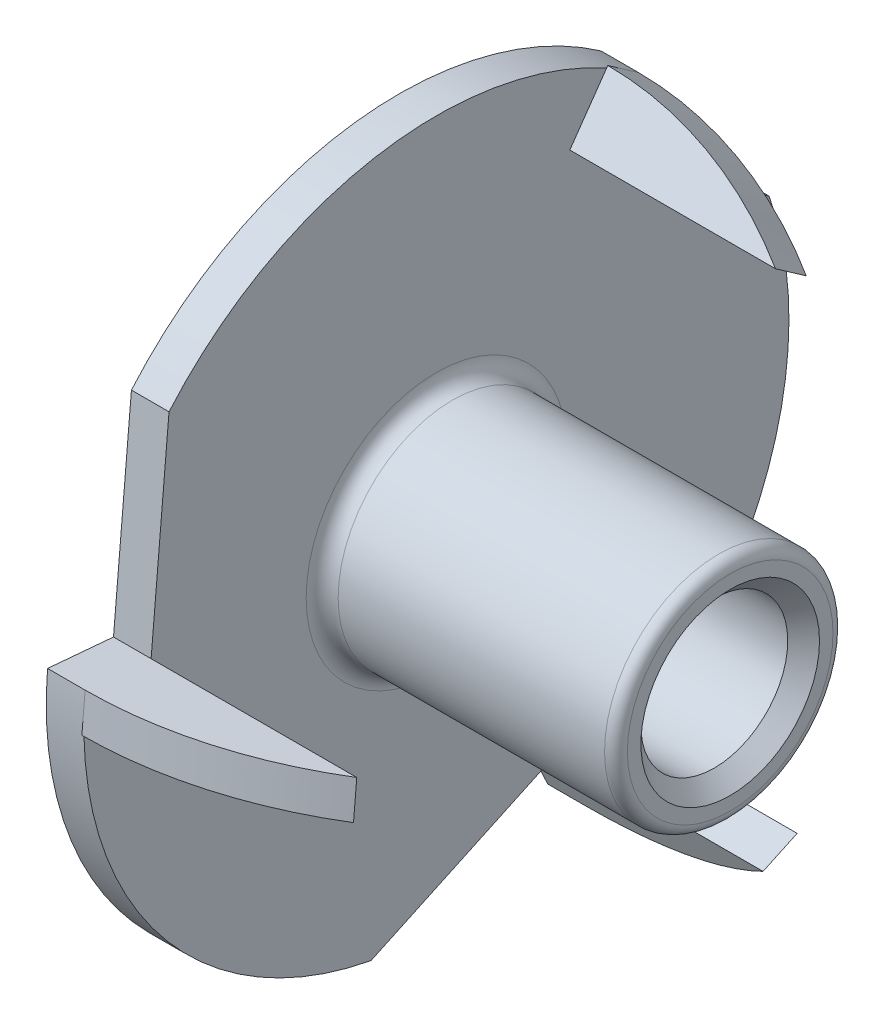
ISO-10303-21;
HEADER;
FILE_DESCRIPTION(('STEP AP214'),'2;1');
FILE_NAME('part.step','',(''),(''),'','','');
FILE_SCHEMA(('AUTOMOTIVE_DESIGN { 1 0 10303 214 1 1 1 1 }'));
ENDSEC;
DATA;
#1=APPLICATION_CONTEXT('core data for automotive mechanical design processes');
#2=APPLICATION_PROTOCOL_DEFINITION('international standard','automotive_design',2000,#1);
#3=PRODUCT_CONTEXT('',#1,'mechanical');
#4=PRODUCT('Part','Part','',(#3));
#5=PRODUCT_RELATED_PRODUCT_CATEGORY('part','',(#4));
#6=PRODUCT_DEFINITION_FORMATION('','',#4);
#7=PRODUCT_DEFINITION_CONTEXT('part definition',#1,'design');
#8=PRODUCT_DEFINITION('design','',#6,#7);
#9=PRODUCT_DEFINITION_SHAPE('','',#8);
#10=(LENGTH_UNIT() NAMED_UNIT(*) SI_UNIT(.MILLI.,.METRE.));
#11=(NAMED_UNIT(*) PLANE_ANGLE_UNIT() SI_UNIT($,.RADIAN.));
#12=(NAMED_UNIT(*) SI_UNIT($,.STERADIAN.) SOLID_ANGLE_UNIT());
#13=UNCERTAINTY_MEASURE_WITH_UNIT(LENGTH_MEASURE(1.E-05),#10,'distance_accuracy_value','');
#14=(GEOMETRIC_REPRESENTATION_CONTEXT(3) GLOBAL_UNCERTAINTY_ASSIGNED_CONTEXT((#13)) GLOBAL_UNIT_ASSIGNED_CONTEXT((#10,
#11,#12)) REPRESENTATION_CONTEXT('',''));
#15=CARTESIAN_POINT('',(0.,0.,0.));
#16=DIRECTION('',(0.,0.,1.));
#17=DIRECTION('',(1.,0.,0.));
#18=AXIS2_PLACEMENT_3D('',#15,#16,#17);
#19=CARTESIAN_POINT('',(8.64489,0.,0.));
#20=DIRECTION('',(1.,0.,0.));
#21=DIRECTION('',(0.,0.,-1.));
#22=AXIS2_PLACEMENT_3D('',#19,#20,#21);
#23=TOROIDAL_SURFACE('',#22,2.77749,0.30861);
#24=CARTESIAN_POINT('',(8.9535,0.,0.));
#25=DIRECTION('',(-1.,0.,0.));
#26=DIRECTION('',(0.,0.,-1.));
#27=AXIS2_PLACEMENT_3D('',#24,#25,#26);
#28=CIRCLE('',#27,2.77749);
#29=CARTESIAN_POINT('',(8.9535,0.,2.77749));
#30=VERTEX_POINT('',#29);
#31=CARTESIAN_POINT('',(8.9535,0.,-2.77749));
#32=VERTEX_POINT('',#31);
#33=EDGE_CURVE('E138',#30,#32,#28,.F.);
#34=ORIENTED_EDGE('',*,*,#33,.F.);
#35=CARTESIAN_POINT('',(8.9535,0.,0.));
#36=DIRECTION('',(-1.,0.,0.));
#37=DIRECTION('',(0.,0.,1.));
#38=AXIS2_PLACEMENT_3D('',#35,#36,#37);
#39=CIRCLE('',#38,2.77749);
#40=EDGE_CURVE('E141',#32,#30,#39,.F.);
#41=ORIENTED_EDGE('',*,*,#40,.F.);
#42=EDGE_LOOP('',(#34,#41));
#43=FACE_BOUND('',#42,.T.);
#44=CARTESIAN_POINT('',(8.64489,0.,0.));
#45=DIRECTION('',(-1.,0.,0.));
#46=DIRECTION('',(0.,0.,1.));
#47=AXIS2_PLACEMENT_3D('',#44,#45,#46);
#48=CIRCLE('',#47,3.0861);
#49=CARTESIAN_POINT('',(8.64489,0.,3.0861));
#50=VERTEX_POINT('',#49);
#51=EDGE_CURVE('E149',#50,#50,#48,.T.);
#52=ORIENTED_EDGE('',*,*,#51,.F.);
#53=EDGE_LOOP('',(#52));
#54=FACE_BOUND('',#53,.T.);
#55=ADVANCED_FACE('F16',(#43,#54),#23,.T.);
#56=CARTESIAN_POINT('',(8.9535,0.,-1.54305));
#57=DIRECTION('',(1.,0.,0.));
#58=DIRECTION('',(0.,0.,-1.));
#59=AXIS2_PLACEMENT_3D('',#56,#57,#58);
#60=PLANE('',#59);
#61=ORIENTED_EDGE('',*,*,#33,.T.);
#62=ORIENTED_EDGE('',*,*,#40,.T.);
#63=EDGE_LOOP('',(#61,#62));
#64=FACE_BOUND('',#63,.T.);
#65=CARTESIAN_POINT('',(8.95350000001827,0.,0.));
#66=DIRECTION('',(1.,0.,0.));
#67=DIRECTION('',(0.,0.,-1.));
#68=AXIS2_PLACEMENT_3D('',#65,#66,#67);
#69=CIRCLE('',#68,2.41299999993316);
#70=CARTESIAN_POINT('',(8.95350000001827,0.,-2.41299999993316));
#71=VERTEX_POINT('',#70);
#72=EDGE_CURVE('E216',#71,#71,#69,.F.);
#73=ORIENTED_EDGE('',*,*,#72,.T.);
#74=EDGE_LOOP('',(#73));
#75=FACE_BOUND('',#74,.T.);
#76=ADVANCED_FACE('F147',(#64,#75),#60,.T.);
#77=CARTESIAN_POINT('',(4.98475,0.,0.));
#78=DIRECTION('',(-1.,0.,0.));
#79=DIRECTION('',(0.,0.,1.));
#80=AXIS2_PLACEMENT_3D('',#77,#78,#79);
#81=CYLINDRICAL_SURFACE('',#80,3.0861);
#82=CARTESIAN_POINT('',(1.44805400254,0.,0.));
#83=DIRECTION('',(1.,0.,0.));
#84=DIRECTION('',(0.,0.,-1.));
#85=AXIS2_PLACEMENT_3D('',#82,#83,#84);
#86=CIRCLE('',#85,3.08610000254);
#87=CARTESIAN_POINT('',(1.44805400254,0.,-3.08610000254));
#88=VERTEX_POINT('',#87);
#89=EDGE_CURVE('E215',#88,#88,#86,.T.);
#90=ORIENTED_EDGE('',*,*,#89,.T.);
#91=EDGE_LOOP('',(#90));
#92=FACE_BOUND('',#91,.T.);
#93=ORIENTED_EDGE('',*,*,#51,.T.);
#94=EDGE_LOOP('',(#93));
#95=FACE_BOUND('',#94,.T.);
#96=ADVANCED_FACE('F166',(#92,#95),#81,.T.);
#97=CARTESIAN_POINT('',(8.95350000013195,0.,0.));
#98=DIRECTION('',(1.,0.,0.));
#99=DIRECTION('',(0.,0.,-1.));
#100=AXIS2_PLACEMENT_3D('',#97,#98,#99);
#101=CONICAL_SURFACE('',#100,2.41300000004685,0.785398163397448);
#102=ORIENTED_EDGE('',*,*,#72,.F.);
#103=EDGE_LOOP('',(#102));
#104=FACE_BOUND('',#103,.T.);
#105=CARTESIAN_POINT('',(8.52424,0.,0.));
#106=DIRECTION('',(-1.,0.,0.));
#107=DIRECTION('',(0.,-1.,0.));
#108=AXIS2_PLACEMENT_3D('',#105,#106,#107);
#109=CIRCLE('',#108,1.98374);
#110=CARTESIAN_POINT('',(8.52424,-1.98374,0.));
#111=VERTEX_POINT('',#110);
#112=EDGE_CURVE('E221',#111,#111,#109,.T.);
#113=ORIENTED_EDGE('',*,*,#112,.T.);
#114=EDGE_LOOP('',(#113));
#115=FACE_BOUND('',#114,.T.);
#116=ADVANCED_FACE('F170',(#104,#115),#101,.F.);
#117=CARTESIAN_POINT('',(3.45747575498561,7.44173273243971,-3.97045037441459));
#118=DIRECTION('',(0.,-0.573576436351046,-0.819152044288992));
#119=DIRECTION('',(0.,0.819152044288992,-0.573576436351046));
#120=AXIS2_PLACEMENT_3D('',#117,#118,#119);
#121=PLANE('',#120);
#122=DIRECTION('',(0.,0.819152044289043,-0.573576436350973));
#123=VECTOR('',#122,1.);
#124=CARTESIAN_POINT('',(1.016,8.34066278230974,-4.59988797165682));
#125=LINE('',#124,#123);
#126=CARTESIAN_POINT('',(1.016,8.34066278230974,-4.59988797165682));
#127=VERTEX_POINT('',#126);
#128=CARTESIAN_POINT('',(1.016,8.38517688118555,-4.63105707924576));
#129=VERTEX_POINT('',#128);
#130=EDGE_CURVE('E213',#127,#129,#125,.T.);
#131=ORIENTED_EDGE('',*,*,#130,.F.);
#132=DIRECTION('',(0.,0.819152044288989,-0.573576436351049));
#133=VECTOR('',#132,1.);
#134=CARTESIAN_POINT('',(1.016,6.92013820387929,-3.60522595362764));
#135=LINE('',#134,#133);
#136=CARTESIAN_POINT('',(1.016,6.92013820387929,-3.60522595362764));
#137=VERTEX_POINT('',#136);
#138=EDGE_CURVE('E473',#137,#127,#135,.T.);
#139=ORIENTED_EDGE('',*,*,#138,.F.);
#140=DIRECTION('',(1.,0.,0.));
#141=VECTOR('',#140,1.);
#142=CARTESIAN_POINT('',(6.57225,6.92013820387928,-3.60522595362764));
#143=LINE('',#142,#141);
#144=CARTESIAN_POINT('',(6.57225000000001,6.92013820387929,-3.60522595362764));
#145=VERTEX_POINT('',#144);
#146=EDGE_CURVE('E204',#145,#137,#143,.F.);
#147=ORIENTED_EDGE('',*,*,#146,.F.);
#148=CARTESIAN_POINT('',(1.01599999999999,0.582753659332648,0.832258476997622));
#149=DIRECTION('',(0.,0.573576436351046,0.819152044288992));
#150=DIRECTION('',(0.,-0.819152044288992,0.573576436351046));
#151=AXIS2_PLACEMENT_3D('',#148,#149,#150);
#152=CIRCLE('',#151,9.52500000000002);
#153=EDGE_CURVE('E212',#129,#145,#152,.F.);
#154=ORIENTED_EDGE('',*,*,#153,.F.);
#155=EDGE_LOOP('',(#131,#139,#147,#154));
#156=FACE_BOUND('',#155,.T.);
#157=ADVANCED_FACE('F174',(#156),#121,.F.);
#158=CARTESIAN_POINT('',(3.45747575498561,-0.282355477511387,8.42995478167427));
#159=DIRECTION('',(0.,0.996194698091746,-0.0871557427476579));
#160=DIRECTION('',(0.,0.0871557427476579,0.996194698091746));
#161=AXIS2_PLACEMENT_3D('',#158,#159,#160);
#162=PLANE('',#161);
#163=DIRECTION('',(0.,0.0871557427476641,0.996194698091745));
#164=VECTOR('',#163,1.);
#165=CARTESIAN_POINT('',(1.016,-0.186711553137597,9.52316983970805));
#166=LINE('',#165,#164);
#167=CARTESIAN_POINT('',(1.016,-0.186711553137597,9.52316983970805));
#168=VERTEX_POINT('',#167);
#169=CARTESIAN_POINT('',(1.016,-0.181975363589741,9.57730473395549));
#170=VERTEX_POINT('',#169);
#171=EDGE_CURVE('E226',#168,#170,#166,.T.);
#172=ORIENTED_EDGE('',*,*,#171,.F.);
#173=DIRECTION('',(0.,0.0871557427476577,0.996194698091746));
#174=VECTOR('',#173,1.);
#175=CARTESIAN_POINT('',(1.016,-0.33785183971513,7.7956284590725));
#176=LINE('',#175,#174);
#177=CARTESIAN_POINT('',(1.016,-0.337851839715131,7.7956284590725));
#178=VERTEX_POINT('',#177);
#179=EDGE_CURVE('E488',#178,#168,#176,.T.);
#180=ORIENTED_EDGE('',*,*,#179,.F.);
#181=DIRECTION('',(1.,0.,0.));
#182=VECTOR('',#181,1.);
#183=CARTESIAN_POINT('',(6.57225,-0.337851839715132,7.79562845907249));
#184=LINE('',#183,#182);
#185=CARTESIAN_POINT('',(6.57225,-0.337851839715131,7.79562845907249));
#186=VERTEX_POINT('',#185);
#187=EDGE_CURVE('E222',#186,#178,#184,.F.);
#188=ORIENTED_EDGE('',*,*,#187,.F.);
#189=CARTESIAN_POINT('',(1.01599999999999,-1.01213381326121,0.0885502346316048));
#190=DIRECTION('',(0.,-0.996194698091746,0.0871557427476579));
#191=DIRECTION('',(0.,-0.0871557427476579,-0.996194698091746));
#192=AXIS2_PLACEMENT_3D('',#189,#190,#191);
#193=CIRCLE('',#192,9.52500000000001);
#194=EDGE_CURVE('E225',#170,#186,#193,.F.);
#195=ORIENTED_EDGE('',*,*,#194,.F.);
#196=EDGE_LOOP('',(#172,#180,#188,#195));
#197=FACE_BOUND('',#196,.T.);
#198=ADVANCED_FACE('F178',(#197),#162,.F.);
#199=CARTESIAN_POINT('',(3.45747575498561,-7.15937725492833,-4.45950440725968));
#200=DIRECTION('',(0.,-0.4226182617407,0.90630778703665));
#201=DIRECTION('',(0.,-0.90630778703665,-0.4226182617407));
#202=AXIS2_PLACEMENT_3D('',#199,#200,#201);
#203=PLANE('',#202);
#204=DIRECTION('',(0.,-0.90630778703665,-0.4226182617407));
#205=VECTOR('',#204,1.);
#206=CARTESIAN_POINT('',(1.016,-7.15937725492833,-4.45950440725968));
#207=LINE('',#206,#205);
#208=CARTESIAN_POINT('',(1.016,-8.15395122917215,-4.92328186805123));
#209=VERTEX_POINT('',#208);
#210=CARTESIAN_POINT('',(1.016,-8.20320151759554,-4.9462476547094));
#211=VERTEX_POINT('',#210);
#212=EDGE_CURVE('E116',#209,#211,#207,.T.);
#213=ORIENTED_EDGE('',*,*,#212,.F.);
#214=DIRECTION('',(0.,-0.906307787036649,-0.422618261740701));
#215=VECTOR('',#214,1.);
#216=CARTESIAN_POINT('',(1.016,-6.58228636416416,-4.19040250544486));
#217=LINE('',#216,#215);
#218=CARTESIAN_POINT('',(1.016,-6.58228636416416,-4.19040250544486));
#219=VERTEX_POINT('',#218);
#220=EDGE_CURVE('E250',#219,#209,#217,.T.);
#221=ORIENTED_EDGE('',*,*,#220,.F.);
#222=DIRECTION('',(1.,0.,0.));
#223=VECTOR('',#222,1.);
#224=CARTESIAN_POINT('',(6.57225,-6.58228636416416,-4.19040250544486));
#225=LINE('',#224,#223);
#226=CARTESIAN_POINT('',(6.57224999999999,-6.58228636416416,-4.19040250544486));
#227=VERTEX_POINT('',#226);
#228=EDGE_CURVE('E217',#227,#219,#225,.F.);
#229=ORIENTED_EDGE('',*,*,#228,.F.);
#230=CARTESIAN_POINT('',(1.01599999999999,0.429380153928564,-0.920808711629228));
#231=DIRECTION('',(0.,0.4226182617407,-0.90630778703665));
#232=DIRECTION('',(0.,0.90630778703665,0.4226182617407));
#233=AXIS2_PLACEMENT_3D('',#230,#231,#232);
#234=CIRCLE('',#233,9.52500000000001);
#235=EDGE_CURVE('E220',#211,#227,#234,.F.);
#236=ORIENTED_EDGE('',*,*,#235,.F.);
#237=EDGE_LOOP('',(#213,#221,#229,#236));
#238=FACE_BOUND('',#237,.T.);
#239=ADVANCED_FACE('F182',(#238),#203,.F.);
#240=CARTESIAN_POINT('',(1.44805400254,0.,0.));
#241=DIRECTION('',(1.,0.,0.));
#242=DIRECTION('',(0.,0.,-1.));
#243=AXIS2_PLACEMENT_3D('',#240,#241,#242);
#244=TOROIDAL_SURFACE('',#243,3.51815400254,0.432054);
#245=ORIENTED_EDGE('',*,*,#89,.F.);
#246=EDGE_LOOP('',(#245));
#247=FACE_BOUND('',#246,.T.);
#248=CARTESIAN_POINT('',(1.01600000254,0.,0.));
#249=DIRECTION('',(1.,0.,0.));
#250=DIRECTION('',(0.,0.,1.));
#251=AXIS2_PLACEMENT_3D('',#248,#249,#250);
#252=CIRCLE('',#251,3.51815400254);
#253=CARTESIAN_POINT('',(1.016000001524,0.,-3.518154002032));
#254=VERTEX_POINT('',#253);
#255=CARTESIAN_POINT('',(1.016000001524,0.,3.518154001016));
#256=VERTEX_POINT('',#255);
#257=EDGE_CURVE('E232',#254,#256,#252,.F.);
#258=ORIENTED_EDGE('',*,*,#257,.F.);
#259=CARTESIAN_POINT('',(1.01600000254,0.,0.));
#260=DIRECTION('',(1.,0.,0.));
#261=DIRECTION('',(0.,0.,-1.));
#262=AXIS2_PLACEMENT_3D('',#259,#260,#261);
#263=CIRCLE('',#262,3.51815400127);
#264=EDGE_CURVE('E124',#256,#254,#263,.F.);
#265=ORIENTED_EDGE('',*,*,#264,.F.);
#266=EDGE_LOOP('',(#258,#265));
#267=FACE_BOUND('',#266,.T.);
#268=ADVANCED_FACE('F186',(#247,#267),#244,.F.);
#269=CARTESIAN_POINT('',(4.47675,0.,0.));
#270=DIRECTION('',(-1.,0.,0.));
#271=DIRECTION('',(0.,-1.,0.));
#272=AXIS2_PLACEMENT_3D('',#269,#270,#271);
#273=CYLINDRICAL_SURFACE('',#272,1.98374);
#274=ORIENTED_EDGE('',*,*,#112,.F.);
#275=EDGE_LOOP('',(#274));
#276=FACE_BOUND('',#275,.T.);
#277=CARTESIAN_POINT('',(0.429259999975784,0.,0.));
#278=DIRECTION('',(-1.,0.,0.));
#279=DIRECTION('',(0.,0.,1.));
#280=AXIS2_PLACEMENT_3D('',#277,#278,#279);
#281=CIRCLE('',#280,1.98374000001422);
#282=CARTESIAN_POINT('',(0.429259999975784,0.,1.98374000001422));
#283=VERTEX_POINT('',#282);
#284=EDGE_CURVE('E199',#283,#283,#281,.T.);
#285=ORIENTED_EDGE('',*,*,#284,.T.);
#286=EDGE_LOOP('',(#285));
#287=FACE_BOUND('',#286,.T.);
#288=ADVANCED_FACE('F192',(#276,#287),#273,.F.);
#289=CARTESIAN_POINT('',(6.57225,-7.01166651809271,-3.26959379381562));
#290=DIRECTION('',(0.,0.90630778703665,0.4226182617407));
#291=DIRECTION('',(0.,-0.4226182617407,0.90630778703665));
#292=AXIS2_PLACEMENT_3D('',#289,#290,#291);
#293=PLANE('',#292);
#294=DIRECTION('',(1.,0.,0.));
#295=VECTOR('',#294,1.);
#296=CARTESIAN_POINT('',(1.016,-7.01166651809271,-3.26959379381563));
#297=LINE('',#296,#295);
#298=CARTESIAN_POINT('',(1.016,-7.01166651809271,-3.26959379381563));
#299=VERTEX_POINT('',#298);
#300=CARTESIAN_POINT('',(6.57224999999999,-7.01166651809271,-3.26959379381563));
#301=VERTEX_POINT('',#300);
#302=EDGE_CURVE('E398',#299,#301,#297,.T.);
#303=ORIENTED_EDGE('',*,*,#302,.T.);
#304=DIRECTION('',(0.,0.4226182617407,-0.90630778703665));
#305=VECTOR('',#304,1.);
#306=CARTESIAN_POINT('',(6.57225,-7.0116665180927,-3.26959379381562));
#307=LINE('',#306,#305);
#308=EDGE_CURVE('E406',#227,#301,#307,.F.);
#309=ORIENTED_EDGE('',*,*,#308,.F.);
#310=ORIENTED_EDGE('',*,*,#228,.T.);
#311=DIRECTION('',(0.,0.422618261740701,-0.906307787036649));
#312=VECTOR('',#311,1.);
#313=CARTESIAN_POINT('',(1.016,-7.01166651809271,-3.26959379381563));
#314=LINE('',#313,#312);
#315=EDGE_CURVE('E497',#299,#219,#314,.T.);
#316=ORIENTED_EDGE('',*,*,#315,.F.);
#317=EDGE_LOOP('',(#303,#309,#310,#316));
#318=FACE_BOUND('',#317,.T.);
#319=ADVANCED_FACE('F290',(#318),#293,.T.);
#320=CARTESIAN_POINT('',(1.01599999999999,0.,0.));
#321=DIRECTION('',(0.,0.4226182617407,-0.90630778703665));
#322=DIRECTION('',(0.,0.90630778703665,0.4226182617407));
#323=AXIS2_PLACEMENT_3D('',#320,#321,#322);
#324=CYLINDRICAL_SURFACE('',#323,9.52500000000001);
#325=CARTESIAN_POINT('',(1.01599999999999,0.,0.));
#326=DIRECTION('',(0.,0.4226182617407,-0.90630778703665));
#327=DIRECTION('',(0.,0.90630778703665,0.4226182617407));
#328=AXIS2_PLACEMENT_3D('',#325,#326,#327);
#329=CIRCLE('',#328,9.52500000000001);
#330=CARTESIAN_POINT('',(1.01599999999999,-8.63258167152409,-4.02543894308017));
#331=VERTEX_POINT('',#330);
#332=EDGE_CURVE('E395',#301,#331,#329,.T.);
#333=ORIENTED_EDGE('',*,*,#332,.T.);
#334=DIRECTION('',(0.,-0.422618261740701,0.906307787036649));
#335=VECTOR('',#334,1.);
#336=CARTESIAN_POINT('',(1.016,-8.20320151759554,-4.9462476547094));
#337=LINE('',#336,#335);
#338=EDGE_CURVE('E241',#211,#331,#337,.T.);
#339=ORIENTED_EDGE('',*,*,#338,.F.);
#340=ORIENTED_EDGE('',*,*,#235,.T.);
#341=ORIENTED_EDGE('',*,*,#308,.T.);
#342=EDGE_LOOP('',(#333,#339,#340,#341));
#343=FACE_BOUND('',#342,.T.);
#344=ADVANCED_FACE('F287',(#343),#324,.T.);
#345=CARTESIAN_POINT('',(1.016,0.674281973546084,7.70707822444088));
#346=DIRECTION('',(-1.,0.,0.));
#347=DIRECTION('',(0.,0.,1.));
#348=AXIS2_PLACEMENT_3D('',#345,#346,#347);
#349=PLANE('',#348);
#350=DIRECTION('',(0.,-0.996194698091746,0.0871557427476579));
#351=VECTOR('',#350,1.);
#352=CARTESIAN_POINT('',(1.016,0.830158449671443,9.48875449932387));
#353=LINE('',#352,#351);
#354=CARTESIAN_POINT('',(1.01599999999999,0.830158449671442,9.48875449932388));
#355=VERTEX_POINT('',#354);
#356=EDGE_CURVE('E482',#355,#170,#353,.T.);
#357=ORIENTED_EDGE('',*,*,#356,.F.);
#358=CARTESIAN_POINT('',(1.016,0.,0.));
#359=DIRECTION('',(-1.,0.,0.));
#360=DIRECTION('',(0.,0.,1.));
#361=AXIS2_PLACEMENT_3D('',#358,#359,#360);
#362=CIRCLE('',#361,9.525);
#363=EDGE_CURVE('E388',#168,#355,#362,.T.);
#364=ORIENTED_EDGE('',*,*,#363,.F.);
#365=ORIENTED_EDGE('',*,*,#171,.T.);
#366=EDGE_LOOP('',(#357,#364,#365));
#367=FACE_BOUND('',#366,.T.);
#368=ADVANCED_FACE('F283',(#367),#349,.T.);
#369=CARTESIAN_POINT('',(6.57225,0.674281973546083,7.70707822444087));
#370=DIRECTION('',(0.,-0.0871557427476579,-0.996194698091746));
#371=DIRECTION('',(0.,0.996194698091746,-0.0871557427476579));
#372=AXIS2_PLACEMENT_3D('',#369,#370,#371);
#373=PLANE('',#372);
#374=DIRECTION('',(1.,0.,0.));
#375=VECTOR('',#374,1.);
#376=CARTESIAN_POINT('',(1.016,0.674281973546085,7.70707822444088));
#377=LINE('',#376,#375);
#378=CARTESIAN_POINT('',(1.016,0.674281973546085,7.70707822444088));
#379=VERTEX_POINT('',#378);
#380=CARTESIAN_POINT('',(6.57224999999999,0.674281973546085,7.70707822444088));
#381=VERTEX_POINT('',#380);
#382=EDGE_CURVE('E387',#379,#381,#377,.T.);
#383=ORIENTED_EDGE('',*,*,#382,.T.);
#384=DIRECTION('',(0.,-0.996194698091746,0.0871557427476579));
#385=VECTOR('',#384,1.);
#386=CARTESIAN_POINT('',(6.57225,0.674281973546083,7.70707822444087));
#387=LINE('',#386,#385);
#388=EDGE_CURVE('E404',#186,#381,#387,.F.);
#389=ORIENTED_EDGE('',*,*,#388,.F.);
#390=ORIENTED_EDGE('',*,*,#187,.T.);
#391=DIRECTION('',(0.,-0.996194698091746,0.0871557427476568));
#392=VECTOR('',#391,1.);
#393=CARTESIAN_POINT('',(1.016,0.674281973546085,7.70707822444088));
#394=LINE('',#393,#392);
#395=EDGE_CURVE('E485',#379,#178,#394,.T.);
#396=ORIENTED_EDGE('',*,*,#395,.F.);
#397=EDGE_LOOP('',(#383,#389,#390,#396));
#398=FACE_BOUND('',#397,.T.);
#399=ADVANCED_FACE('F279',(#398),#373,.T.);
#400=CARTESIAN_POINT('',(1.01599999999999,0.,0.));
#401=DIRECTION('',(0.,-0.996194698091746,0.0871557427476579));
#402=DIRECTION('',(0.,-0.0871557427476579,-0.996194698091746));
#403=AXIS2_PLACEMENT_3D('',#400,#401,#402);
#404=CYLINDRICAL_SURFACE('',#403,9.52500000000001);
#405=CARTESIAN_POINT('',(1.01599999999999,0.,0.));
#406=DIRECTION('',(0.,-0.996194698091746,0.0871557427476579));
#407=DIRECTION('',(0.,-0.0871557427476579,-0.996194698091746));
#408=AXIS2_PLACEMENT_3D('',#405,#406,#407);
#409=CIRCLE('',#408,9.52500000000001);
#410=EDGE_CURVE('E383',#381,#355,#409,.T.);
#411=ORIENTED_EDGE('',*,*,#410,.T.);
#412=ORIENTED_EDGE('',*,*,#356,.T.);
#413=ORIENTED_EDGE('',*,*,#194,.T.);
#414=ORIENTED_EDGE('',*,*,#388,.T.);
#415=EDGE_LOOP('',(#411,#412,#413,#414));
#416=FACE_BOUND('',#415,.T.);
#417=ADVANCED_FACE('F275',(#416),#404,.T.);
#418=CARTESIAN_POINT('',(1.016,6.33738454454662,-4.43748443062526));
#419=DIRECTION('',(-1.,0.,0.));
#420=DIRECTION('',(0.,0.,1.));
#421=AXIS2_PLACEMENT_3D('',#418,#419,#420);
#422=PLANE('',#421);
#423=ORIENTED_EDGE('',*,*,#130,.T.);
#424=DIRECTION('',(0.,0.573576436351046,0.819152044288992));
#425=VECTOR('',#424,1.);
#426=CARTESIAN_POINT('',(1.016,7.80242322185265,-5.46331555624372));
#427=LINE('',#426,#425);
#428=CARTESIAN_POINT('',(1.01599999999999,7.80242322185265,-5.46331555624372));
#429=VERTEX_POINT('',#428);
#430=EDGE_CURVE('E477',#429,#129,#427,.T.);
#431=ORIENTED_EDGE('',*,*,#430,.F.);
#432=CARTESIAN_POINT('',(1.016,0.,0.));
#433=DIRECTION('',(-1.,0.,0.));
#434=DIRECTION('',(0.,0.,1.));
#435=AXIS2_PLACEMENT_3D('',#432,#433,#434);
#436=CIRCLE('',#435,9.525);
#437=EDGE_CURVE('E376',#127,#429,#436,.T.);
#438=ORIENTED_EDGE('',*,*,#437,.F.);
#439=EDGE_LOOP('',(#423,#431,#438));
#440=FACE_BOUND('',#439,.T.);
#441=ADVANCED_FACE('F271',(#440),#422,.T.);
#442=CARTESIAN_POINT('',(6.57225,6.33738454454662,-4.43748443062526));
#443=DIRECTION('',(0.,-0.819152044288992,0.573576436351046));
#444=DIRECTION('',(0.,-0.573576436351046,-0.819152044288992));
#445=AXIS2_PLACEMENT_3D('',#442,#443,#444);
#446=PLANE('',#445);
#447=DIRECTION('',(1.,0.,0.));
#448=VECTOR('',#447,1.);
#449=CARTESIAN_POINT('',(1.016,6.33738454454663,-4.43748443062525));
#450=LINE('',#449,#448);
#451=CARTESIAN_POINT('',(1.016,6.33738454454663,-4.43748443062525));
#452=VERTEX_POINT('',#451);
#453=CARTESIAN_POINT('',(6.57225,6.33738454454663,-4.43748443062526));
#454=VERTEX_POINT('',#453);
#455=EDGE_CURVE('E375',#452,#454,#450,.T.);
#456=ORIENTED_EDGE('',*,*,#455,.T.);
#457=DIRECTION('',(0.,0.573576436351046,0.819152044288992));
#458=VECTOR('',#457,1.);
#459=CARTESIAN_POINT('',(6.57225000000001,6.33738454454663,-4.43748443062526));
#460=LINE('',#459,#458);
#461=EDGE_CURVE('E401',#145,#454,#460,.F.);
#462=ORIENTED_EDGE('',*,*,#461,.F.);
#463=ORIENTED_EDGE('',*,*,#146,.T.);
#464=DIRECTION('',(0.,0.573576436351047,0.819152044288991));
#465=VECTOR('',#464,1.);
#466=CARTESIAN_POINT('',(1.016,6.33738454454663,-4.43748443062525));
#467=LINE('',#466,#465);
#468=EDGE_CURVE('E236',#452,#137,#467,.T.);
#469=ORIENTED_EDGE('',*,*,#468,.F.);
#470=EDGE_LOOP('',(#456,#462,#463,#469));
#471=FACE_BOUND('',#470,.T.);
#472=ADVANCED_FACE('F267',(#471),#446,.T.);
#473=CARTESIAN_POINT('',(1.01599999999999,0.,0.));
#474=DIRECTION('',(0.,0.573576436351046,0.819152044288992));
#475=DIRECTION('',(0.,-0.819152044288992,0.573576436351046));
#476=AXIS2_PLACEMENT_3D('',#473,#474,#475);
#477=CYLINDRICAL_SURFACE('',#476,9.52500000000002);
#478=CARTESIAN_POINT('',(1.01599999999999,0.,0.));
#479=DIRECTION('',(0.,0.573576436351046,0.819152044288992));
#480=DIRECTION('',(0.,-0.819152044288992,0.573576436351046));
#481=AXIS2_PLACEMENT_3D('',#478,#479,#480);
#482=CIRCLE('',#481,9.52500000000002);
#483=EDGE_CURVE('E371',#454,#429,#482,.T.);
#484=ORIENTED_EDGE('',*,*,#483,.T.);
#485=ORIENTED_EDGE('',*,*,#430,.T.);
#486=ORIENTED_EDGE('',*,*,#153,.T.);
#487=ORIENTED_EDGE('',*,*,#461,.T.);
#488=EDGE_LOOP('',(#484,#485,#486,#487));
#489=FACE_BOUND('',#488,.T.);
#490=ADVANCED_FACE('F262',(#489),#477,.T.);
#491=CARTESIAN_POINT('',(1.016,0.,-4.7625));
#492=DIRECTION('',(1.,0.,0.));
#493=DIRECTION('',(0.,0.,-1.));
#494=AXIS2_PLACEMENT_3D('',#491,#492,#493);
#495=PLANE('',#494);
#496=ORIENTED_EDGE('',*,*,#257,.T.);
#497=ORIENTED_EDGE('',*,*,#264,.T.);
#498=EDGE_LOOP('',(#496,#497));
#499=FACE_BOUND('',#498,.T.);
#500=DIRECTION('',(0.,-0.573576436351046,-0.819152044288992));
#501=VECTOR('',#500,1.);
#502=CARTESIAN_POINT('',(1.016,6.33738454454663,-4.43748443062525));
#503=LINE('',#502,#501);
#504=CARTESIAN_POINT('',(1.016,3.15045047007113,-8.98889797670597));
#505=VERTEX_POINT('',#504);
#506=EDGE_CURVE('E439',#505,#452,#503,.F.);
#507=ORIENTED_EDGE('',*,*,#506,.T.);
#508=ORIENTED_EDGE('',*,*,#468,.T.);
#509=ORIENTED_EDGE('',*,*,#138,.T.);
#510=CARTESIAN_POINT('',(1.016,0.,0.));
#511=DIRECTION('',(-1.,0.,0.));
#512=DIRECTION('',(0.,0.,1.));
#513=AXIS2_PLACEMENT_3D('',#510,#511,#512);
#514=CIRCLE('',#513,9.525);
#515=CARTESIAN_POINT('',(1.016,6.20938876481834,7.2228191287992));
#516=VERTEX_POINT('',#515);
#517=EDGE_CURVE('E379',#516,#127,#514,.T.);
#518=ORIENTED_EDGE('',*,*,#517,.F.);
#519=DIRECTION('',(0.,0.996194698091746,-0.0871557427476581));
#520=VECTOR('',#519,1.);
#521=CARTESIAN_POINT('',(1.016,0.674281973546085,7.70707822444088));
#522=LINE('',#521,#520);
#523=EDGE_CURVE('E447',#516,#379,#522,.F.);
#524=ORIENTED_EDGE('',*,*,#523,.T.);
#525=ORIENTED_EDGE('',*,*,#395,.T.);
#526=ORIENTED_EDGE('',*,*,#179,.T.);
#527=CARTESIAN_POINT('',(1.016,0.,0.));
#528=DIRECTION('',(-1.,0.,0.));
#529=DIRECTION('',(0.,0.,1.));
#530=AXIS2_PLACEMENT_3D('',#527,#528,#529);
#531=CIRCLE('',#530,9.525);
#532=CARTESIAN_POINT('',(1.016,-9.35983923488947,1.76607884790676));
#533=VERTEX_POINT('',#532);
#534=EDGE_CURVE('E391',#533,#168,#531,.T.);
#535=ORIENTED_EDGE('',*,*,#534,.F.);
#536=DIRECTION('',(0.,-0.4226182617407,0.90630778703665));
#537=VECTOR('',#536,1.);
#538=CARTESIAN_POINT('',(1.016,-7.01166651809271,-3.26959379381563));
#539=LINE('',#538,#537);
#540=EDGE_CURVE('E397',#533,#299,#539,.F.);
#541=ORIENTED_EDGE('',*,*,#540,.T.);
#542=ORIENTED_EDGE('',*,*,#315,.T.);
#543=ORIENTED_EDGE('',*,*,#220,.T.);
#544=CARTESIAN_POINT('',(1.016,0.,0.));
#545=DIRECTION('',(-1.,0.,0.));
#546=DIRECTION('',(0.,0.,1.));
#547=AXIS2_PLACEMENT_3D('',#544,#545,#546);
#548=CIRCLE('',#547,9.525);
#549=EDGE_CURVE('E368',#505,#209,#548,.T.);
#550=ORIENTED_EDGE('',*,*,#549,.F.);
#551=EDGE_LOOP('',(#507,#508,#509,#518,#524,#525,#526,#535,#541,#542,#543,#550));
#552=FACE_BOUND('',#551,.T.);
#553=ADVANCED_FACE('F239',(#499,#552),#495,.T.);
#554=CARTESIAN_POINT('',(1.016,-7.01166651809271,-3.26959379381562));
#555=DIRECTION('',(-1.,0.,0.));
#556=DIRECTION('',(0.,0.,1.));
#557=AXIS2_PLACEMENT_3D('',#554,#555,#556);
#558=PLANE('',#557);
#559=ORIENTED_EDGE('',*,*,#212,.T.);
#560=ORIENTED_EDGE('',*,*,#338,.T.);
#561=CARTESIAN_POINT('',(1.016,0.,0.));
#562=DIRECTION('',(-1.,0.,0.));
#563=DIRECTION('',(0.,0.,1.));
#564=AXIS2_PLACEMENT_3D('',#561,#562,#563);
#565=CIRCLE('',#564,9.525);
#566=EDGE_CURVE('E360',#209,#331,#565,.T.);
#567=ORIENTED_EDGE('',*,*,#566,.F.);
#568=EDGE_LOOP('',(#559,#560,#567));
#569=FACE_BOUND('',#568,.T.);
#570=ADVANCED_FACE('F261',(#569),#558,.T.);
#571=CARTESIAN_POINT('',(-5.68432711120514E-11,0.,0.));
#572=DIRECTION('',(-1.,0.,0.));
#573=DIRECTION('',(0.,-1.,0.));
#574=AXIS2_PLACEMENT_3D('',#571,#572,#573);
#575=CONICAL_SURFACE('',#574,2.41300000004685,0.785398163397448);
#576=ORIENTED_EDGE('',*,*,#284,.F.);
#577=EDGE_LOOP('',(#576));
#578=FACE_BOUND('',#577,.T.);
#579=CARTESIAN_POINT('',(1.13686985470373E-10,0.,0.));
#580=DIRECTION('',(-1.,0.,0.));
#581=DIRECTION('',(0.,-1.,0.));
#582=AXIS2_PLACEMENT_3D('',#579,#580,#581);
#583=CIRCLE('',#582,2.41299999987632);
#584=CARTESIAN_POINT('',(1.13687280967886E-10,-2.41299999987632,0.));
#585=VERTEX_POINT('',#584);
#586=EDGE_CURVE('E352',#585,#585,#583,.F.);
#587=ORIENTED_EDGE('',*,*,#586,.F.);
#588=EDGE_LOOP('',(#587));
#589=FACE_BOUND('',#588,.T.);
#590=ADVANCED_FACE('F340',(#578,#589),#575,.F.);
#591=CARTESIAN_POINT('',(1.016,-8.63258167152409,-4.02543894308017));
#592=DIRECTION('',(0.,0.4226182617407,-0.90630778703665));
#593=DIRECTION('',(0.,0.90630778703665,0.4226182617407));
#594=AXIS2_PLACEMENT_3D('',#591,#592,#593);
#595=PLANE('',#594);
#596=DIRECTION('',(-1.,0.,0.));
#597=VECTOR('',#596,1.);
#598=CARTESIAN_POINT('',(0.508,-8.63258167152409,-4.02543894308018));
#599=LINE('',#598,#597);
#600=CARTESIAN_POINT('',(0.,-8.63258167152409,-4.02543894308017));
#601=VERTEX_POINT('',#600);
#602=EDGE_CURVE('E354',#331,#601,#599,.T.);
#603=ORIENTED_EDGE('',*,*,#602,.F.);
#604=ORIENTED_EDGE('',*,*,#332,.F.);
#605=ORIENTED_EDGE('',*,*,#302,.F.);
#606=DIRECTION('',(1.,0.,0.));
#607=VECTOR('',#606,1.);
#608=CARTESIAN_POINT('',(1.016,-7.01166651809271,-3.26959379381563));
#609=LINE('',#608,#607);
#610=CARTESIAN_POINT('',(0.,-7.01166651809271,-3.26959379381563));
#611=VERTEX_POINT('',#610);
#612=EDGE_CURVE('E453',#299,#611,#609,.F.);
#613=ORIENTED_EDGE('',*,*,#612,.T.);
#614=DIRECTION('',(0.,0.906307787036649,0.4226182617407));
#615=VECTOR('',#614,1.);
#616=CARTESIAN_POINT('',(0.,-8.63258167152409,-4.02543894308017));
#617=LINE('',#616,#615);
#618=EDGE_CURVE('E353',#601,#611,#617,.T.);
#619=ORIENTED_EDGE('',*,*,#618,.F.);
#620=EDGE_LOOP('',(#603,#604,#605,#613,#619));
#621=FACE_BOUND('',#620,.T.);
#622=ADVANCED_FACE('F337',(#621),#595,.F.);
#623=CARTESIAN_POINT('',(1.016,-7.01166651809271,-3.26959379381563));
#624=DIRECTION('',(0.,0.90630778703665,0.4226182617407));
#625=DIRECTION('',(0.,-0.4226182617407,0.90630778703665));
#626=AXIS2_PLACEMENT_3D('',#623,#624,#625);
#627=PLANE('',#626);
#628=ORIENTED_EDGE('',*,*,#612,.F.);
#629=ORIENTED_EDGE('',*,*,#540,.F.);
#630=DIRECTION('',(-1.,0.,0.));
#631=VECTOR('',#630,1.);
#632=CARTESIAN_POINT('',(0.508,-9.35983923488947,1.76607884790676));
#633=LINE('',#632,#631);
#634=CARTESIAN_POINT('',(0.,-9.35983923488947,1.76607884790676));
#635=VERTEX_POINT('',#634);
#636=EDGE_CURVE('E394',#635,#533,#633,.F.);
#637=ORIENTED_EDGE('',*,*,#636,.F.);
#638=DIRECTION('',(0.,-0.422618261740699,0.90630778703665));
#639=VECTOR('',#638,1.);
#640=CARTESIAN_POINT('',(0.,-7.01166651809271,-3.26959379381563));
#641=LINE('',#640,#639);
#642=EDGE_CURVE('E357',#611,#635,#641,.T.);
#643=ORIENTED_EDGE('',*,*,#642,.F.);
#644=EDGE_LOOP('',(#628,#629,#637,#643));
#645=FACE_BOUND('',#644,.T.);
#646=ADVANCED_FACE('F333',(#645),#627,.F.);
#647=CARTESIAN_POINT('',(0.508,0.,0.));
#648=DIRECTION('',(-1.,0.,0.));
#649=DIRECTION('',(0.,0.,1.));
#650=AXIS2_PLACEMENT_3D('',#647,#648,#649);
#651=CYLINDRICAL_SURFACE('',#650,9.525);
#652=DIRECTION('',(1.,0.,0.));
#653=VECTOR('',#652,1.);
#654=CARTESIAN_POINT('',(1.016,0.830158449671445,9.48875449932388));
#655=LINE('',#654,#653);
#656=CARTESIAN_POINT('',(0.,0.830158449671444,9.48875449932388));
#657=VERTEX_POINT('',#656);
#658=EDGE_CURVE('E386',#355,#657,#655,.F.);
#659=ORIENTED_EDGE('',*,*,#658,.T.);
#660=CARTESIAN_POINT('',(0.,0.,0.));
#661=DIRECTION('',(-1.,0.,0.));
#662=DIRECTION('',(0.,0.,1.));
#663=AXIS2_PLACEMENT_3D('',#660,#661,#662);
#664=CIRCLE('',#663,9.525);
#665=EDGE_CURVE('E364',#635,#657,#664,.T.);
#666=ORIENTED_EDGE('',*,*,#665,.F.);
#667=ORIENTED_EDGE('',*,*,#636,.T.);
#668=ORIENTED_EDGE('',*,*,#534,.T.);
#669=ORIENTED_EDGE('',*,*,#363,.T.);
#670=EDGE_LOOP('',(#659,#666,#667,#668,#669));
#671=FACE_BOUND('',#670,.T.);
#672=ADVANCED_FACE('F329',(#671),#651,.T.);
#673=CARTESIAN_POINT('',(1.016,0.830158449671445,9.48875449932388));
#674=DIRECTION('',(0.,-0.996194698091746,0.0871557427476581));
#675=DIRECTION('',(0.,-0.0871557427476581,-0.996194698091746));
#676=AXIS2_PLACEMENT_3D('',#673,#674,#675);
#677=PLANE('',#676);
#678=ORIENTED_EDGE('',*,*,#658,.F.);
#679=ORIENTED_EDGE('',*,*,#410,.F.);
#680=ORIENTED_EDGE('',*,*,#382,.F.);
#681=DIRECTION('',(1.,0.,0.));
#682=VECTOR('',#681,1.);
#683=CARTESIAN_POINT('',(1.016,0.674281973546085,7.70707822444088));
#684=LINE('',#683,#682);
#685=CARTESIAN_POINT('',(0.,0.674281973546085,7.70707822444088));
#686=VERTEX_POINT('',#685);
#687=EDGE_CURVE('E444',#379,#686,#684,.F.);
#688=ORIENTED_EDGE('',*,*,#687,.T.);
#689=DIRECTION('',(0.,-0.0871557427476573,-0.996194698091746));
#690=VECTOR('',#689,1.);
#691=CARTESIAN_POINT('',(0.,0.830158449671444,9.48875449932388));
#692=LINE('',#691,#690);
#693=EDGE_CURVE('E427',#657,#686,#692,.T.);
#694=ORIENTED_EDGE('',*,*,#693,.F.);
#695=EDGE_LOOP('',(#678,#679,#680,#688,#694));
#696=FACE_BOUND('',#695,.T.);
#697=ADVANCED_FACE('F325',(#696),#677,.F.);
#698=CARTESIAN_POINT('',(1.016,0.674281973546085,7.70707822444088));
#699=DIRECTION('',(0.,-0.0871557427476581,-0.996194698091746));
#700=DIRECTION('',(0.,0.996194698091746,-0.0871557427476581));
#701=AXIS2_PLACEMENT_3D('',#698,#699,#700);
#702=PLANE('',#701);
#703=ORIENTED_EDGE('',*,*,#687,.F.);
#704=ORIENTED_EDGE('',*,*,#523,.F.);
#705=DIRECTION('',(-1.,0.,0.));
#706=VECTOR('',#705,1.);
#707=CARTESIAN_POINT('',(0.508,6.20938876481834,7.2228191287992));
#708=LINE('',#707,#706);
#709=CARTESIAN_POINT('',(0.,6.20938876481835,7.2228191287992));
#710=VERTEX_POINT('',#709);
#711=EDGE_CURVE('E382',#710,#516,#708,.F.);
#712=ORIENTED_EDGE('',*,*,#711,.F.);
#713=DIRECTION('',(0.,0.996194698091745,-0.0871557427476589));
#714=VECTOR('',#713,1.);
#715=CARTESIAN_POINT('',(0.,0.674281973546085,7.70707822444088));
#716=LINE('',#715,#714);
#717=EDGE_CURVE('E422',#686,#710,#716,.T.);
#718=ORIENTED_EDGE('',*,*,#717,.F.);
#719=EDGE_LOOP('',(#703,#704,#712,#718));
#720=FACE_BOUND('',#719,.T.);
#721=ADVANCED_FACE('F321',(#720),#702,.F.);
#722=CARTESIAN_POINT('',(0.508,0.,0.));
#723=DIRECTION('',(-1.,0.,0.));
#724=DIRECTION('',(0.,0.,1.));
#725=AXIS2_PLACEMENT_3D('',#722,#723,#724);
#726=CYLINDRICAL_SURFACE('',#725,9.525);
#727=ORIENTED_EDGE('',*,*,#517,.T.);
#728=ORIENTED_EDGE('',*,*,#437,.T.);
#729=DIRECTION('',(1.,0.,0.));
#730=VECTOR('',#729,1.);
#731=CARTESIAN_POINT('',(1.016,7.80242322185265,-5.46331555624371));
#732=LINE('',#731,#730);
#733=CARTESIAN_POINT('',(0.,7.80242322185265,-5.46331555624371));
#734=VERTEX_POINT('',#733);
#735=EDGE_CURVE('E374',#429,#734,#732,.F.);
#736=ORIENTED_EDGE('',*,*,#735,.T.);
#737=CARTESIAN_POINT('',(0.,0.,0.));
#738=DIRECTION('',(-1.,0.,0.));
#739=DIRECTION('',(0.,0.,1.));
#740=AXIS2_PLACEMENT_3D('',#737,#738,#739);
#741=CIRCLE('',#740,9.525);
#742=EDGE_CURVE('E419',#710,#734,#741,.T.);
#743=ORIENTED_EDGE('',*,*,#742,.F.);
#744=ORIENTED_EDGE('',*,*,#711,.T.);
#745=EDGE_LOOP('',(#727,#728,#736,#743,#744));
#746=FACE_BOUND('',#745,.T.);
#747=ADVANCED_FACE('F317',(#746),#726,.T.);
#748=CARTESIAN_POINT('',(1.016,7.80242322185265,-5.46331555624371));
#749=DIRECTION('',(0.,0.573576436351046,0.819152044288992));
#750=DIRECTION('',(0.,-0.819152044288992,0.573576436351046));
#751=AXIS2_PLACEMENT_3D('',#748,#749,#750);
#752=PLANE('',#751);
#753=ORIENTED_EDGE('',*,*,#735,.F.);
#754=ORIENTED_EDGE('',*,*,#483,.F.);
#755=ORIENTED_EDGE('',*,*,#455,.F.);
#756=DIRECTION('',(1.,0.,0.));
#757=VECTOR('',#756,1.);
#758=CARTESIAN_POINT('',(1.016,6.33738454454663,-4.43748443062525));
#759=LINE('',#758,#757);
#760=CARTESIAN_POINT('',(0.,6.33738454454663,-4.43748443062525));
#761=VERTEX_POINT('',#760);
#762=EDGE_CURVE('E437',#452,#761,#759,.F.);
#763=ORIENTED_EDGE('',*,*,#762,.T.);
#764=DIRECTION('',(0.,-0.819152044288991,0.573576436351047));
#765=VECTOR('',#764,1.);
#766=CARTESIAN_POINT('',(0.,7.80242322185265,-5.46331555624371));
#767=LINE('',#766,#765);
#768=EDGE_CURVE('E421',#734,#761,#767,.T.);
#769=ORIENTED_EDGE('',*,*,#768,.F.);
#770=EDGE_LOOP('',(#753,#754,#755,#763,#769));
#771=FACE_BOUND('',#770,.T.);
#772=ADVANCED_FACE('F314',(#771),#752,.F.);
#773=CARTESIAN_POINT('',(1.016,6.33738454454663,-4.43748443062525));
#774=DIRECTION('',(0.,-0.819152044288992,0.573576436351046));
#775=DIRECTION('',(0.,-0.573576436351046,-0.819152044288992));
#776=AXIS2_PLACEMENT_3D('',#773,#774,#775);
#777=PLANE('',#776);
#778=ORIENTED_EDGE('',*,*,#762,.F.);
#779=ORIENTED_EDGE('',*,*,#506,.F.);
#780=DIRECTION('',(-1.,0.,0.));
#781=VECTOR('',#780,1.);
#782=CARTESIAN_POINT('',(0.508000000000001,3.15045047007113,-8.98889797670597));
#783=LINE('',#782,#781);
#784=CARTESIAN_POINT('',(0.,3.15045047007113,-8.98889797670597));
#785=VERTEX_POINT('',#784);
#786=EDGE_CURVE('E37',#785,#505,#783,.F.);
#787=ORIENTED_EDGE('',*,*,#786,.F.);
#788=DIRECTION('',(0.,-0.573576436351046,-0.819152044288992));
#789=VECTOR('',#788,1.);
#790=CARTESIAN_POINT('',(0.,6.33738454454663,-4.43748443062525));
#791=LINE('',#790,#789);
#792=EDGE_CURVE('E28',#761,#785,#791,.T.);
#793=ORIENTED_EDGE('',*,*,#792,.F.);
#794=EDGE_LOOP('',(#778,#779,#787,#793));
#795=FACE_BOUND('',#794,.T.);
#796=ADVANCED_FACE('F307',(#795),#777,.F.);
#797=CARTESIAN_POINT('',(0.508,0.,0.));
#798=DIRECTION('',(-1.,0.,0.));
#799=DIRECTION('',(0.,0.,1.));
#800=AXIS2_PLACEMENT_3D('',#797,#798,#799);
#801=CYLINDRICAL_SURFACE('',#800,9.525);
#802=ORIENTED_EDGE('',*,*,#602,.T.);
#803=CARTESIAN_POINT('',(0.,0.,0.));
#804=DIRECTION('',(-1.,0.,0.));
#805=DIRECTION('',(0.,0.,1.));
#806=AXIS2_PLACEMENT_3D('',#803,#804,#805);
#807=CIRCLE('',#806,9.525);
#808=EDGE_CURVE('E9',#785,#601,#807,.T.);
#809=ORIENTED_EDGE('',*,*,#808,.F.);
#810=ORIENTED_EDGE('',*,*,#786,.T.);
#811=ORIENTED_EDGE('',*,*,#549,.T.);
#812=ORIENTED_EDGE('',*,*,#566,.T.);
#813=EDGE_LOOP('',(#802,#809,#810,#811,#812));
#814=FACE_BOUND('',#813,.T.);
#815=ADVANCED_FACE('F301',(#814),#801,.T.);
#816=CARTESIAN_POINT('',(0.,0.,-4.7625));
#817=DIRECTION('',(-1.,0.,0.));
#818=DIRECTION('',(0.,0.,1.));
#819=AXIS2_PLACEMENT_3D('',#816,#817,#818);
#820=PLANE('',#819);
#821=ORIENTED_EDGE('',*,*,#808,.T.);
#822=ORIENTED_EDGE('',*,*,#618,.T.);
#823=ORIENTED_EDGE('',*,*,#642,.T.);
#824=ORIENTED_EDGE('',*,*,#665,.T.);
#825=ORIENTED_EDGE('',*,*,#693,.T.);
#826=ORIENTED_EDGE('',*,*,#717,.T.);
#827=ORIENTED_EDGE('',*,*,#742,.T.);
#828=ORIENTED_EDGE('',*,*,#768,.T.);
#829=ORIENTED_EDGE('',*,*,#792,.T.);
#830=EDGE_LOOP('',(#821,#822,#823,#824,#825,#826,#827,#828,#829));
#831=FACE_BOUND('',#830,.T.);
#832=ORIENTED_EDGE('',*,*,#586,.T.);
#833=EDGE_LOOP('',(#832));
#834=FACE_BOUND('',#833,.T.);
#835=ADVANCED_FACE('F299',(#831,#834),#820,.T.);
#836=CLOSED_SHELL('',(#55,#76,#96,#116,#157,#198,#239,#268,#288,#319,#344,#368,#399,#417,#441,
#472,#490,#553,#570,#590,#622,#646,#672,#697,#721,#747,#772,#796,#815,#835));
#837=MANIFOLD_SOLID_BREP('B1',#836);
#838=ADVANCED_BREP_SHAPE_REPRESENTATION('',(#18,#837),#14);
#839=SHAPE_DEFINITION_REPRESENTATION(#9,#838);
ENDSEC;
END-ISO-10303-21;
